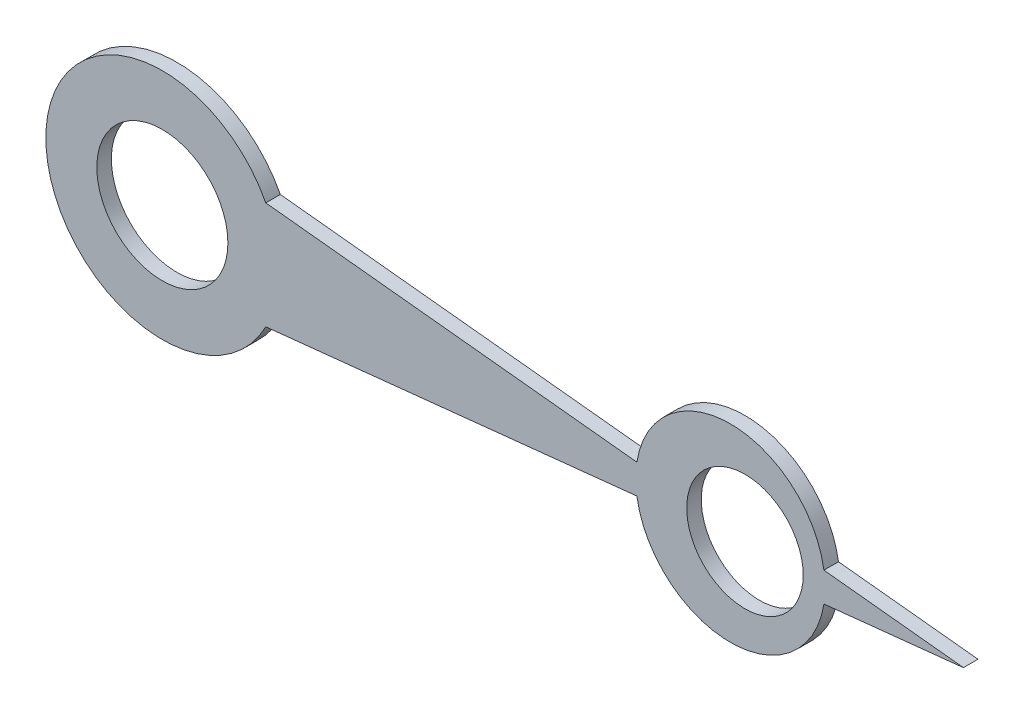
ISO-10303-21;
HEADER;
FILE_DESCRIPTION(('STEP AP214'),'2;1');
FILE_NAME('part.step','',(''),(''),'','','');
FILE_SCHEMA(('AUTOMOTIVE_DESIGN { 1 0 10303 214 1 1 1 1 }'));
ENDSEC;
DATA;
#1=APPLICATION_CONTEXT('core data for automotive mechanical design processes');
#2=APPLICATION_PROTOCOL_DEFINITION('international standard','automotive_design',2000,#1);
#3=PRODUCT_CONTEXT('',#1,'mechanical');
#4=PRODUCT('Part','Part','',(#3));
#5=PRODUCT_RELATED_PRODUCT_CATEGORY('part','',(#4));
#6=PRODUCT_DEFINITION_FORMATION('','',#4);
#7=PRODUCT_DEFINITION_CONTEXT('part definition',#1,'design');
#8=PRODUCT_DEFINITION('design','',#6,#7);
#9=PRODUCT_DEFINITION_SHAPE('','',#8);
#10=(LENGTH_UNIT() NAMED_UNIT(*) SI_UNIT(.MILLI.,.METRE.));
#11=(NAMED_UNIT(*) PLANE_ANGLE_UNIT() SI_UNIT($,.RADIAN.));
#12=(NAMED_UNIT(*) SI_UNIT($,.STERADIAN.) SOLID_ANGLE_UNIT());
#13=UNCERTAINTY_MEASURE_WITH_UNIT(LENGTH_MEASURE(1.E-05),#10,'distance_accuracy_value','');
#14=(GEOMETRIC_REPRESENTATION_CONTEXT(3) GLOBAL_UNCERTAINTY_ASSIGNED_CONTEXT((#13)) GLOBAL_UNIT_ASSIGNED_CONTEXT((#10,
#11,#12)) REPRESENTATION_CONTEXT('',''));
#15=CARTESIAN_POINT('',(0.,0.,0.));
#16=DIRECTION('',(0.,0.,1.));
#17=DIRECTION('',(1.,0.,0.));
#18=AXIS2_PLACEMENT_3D('',#15,#16,#17);
#19=CARTESIAN_POINT('',(39.,0.,20.));
#20=DIRECTION('',(0.,0.,1.));
#21=DIRECTION('',(1.,0.,0.));
#22=AXIS2_PLACEMENT_3D('',#19,#20,#21);
#23=PLANE('',#22);
#24=CARTESIAN_POINT('',(0.,0.,20.));
#25=DIRECTION('',(0.,0.,1.));
#26=DIRECTION('',(1.,0.,0.));
#27=AXIS2_PLACEMENT_3D('',#24,#25,#26);
#28=CIRCLE('',#27,4.5);
#29=CARTESIAN_POINT('',(4.5,0.,20.));
#30=VERTEX_POINT('',#29);
#31=EDGE_CURVE('E129',#30,#30,#28,.T.);
#32=ORIENTED_EDGE('',*,*,#31,.F.);
#33=EDGE_LOOP('',(#32));
#34=FACE_BOUND('',#33,.T.);
#35=DIRECTION('',(-0.994521895368274,0.104528463267647,0.));
#36=VECTOR('',#35,1.);
#37=CARTESIAN_POINT('',(55.,0.,20.));
#38=LINE('',#37,#36);
#39=CARTESIAN_POINT('',(55.,0.,20.));
#40=VERTEX_POINT('',#39);
#41=CARTESIAN_POINT('',(45.4215641633167,1.00673417365588,20.));
#42=VERTEX_POINT('',#41);
#43=EDGE_CURVE('E138',#40,#42,#38,.T.);
#44=ORIENTED_EDGE('',*,*,#43,.T.);
#45=CARTESIAN_POINT('',(39.,0.,20.));
#46=DIRECTION('',(0.,0.,1.));
#47=DIRECTION('',(1.,0.,0.));
#48=AXIS2_PLACEMENT_3D('',#45,#46,#47);
#49=CIRCLE('',#48,6.5);
#50=CARTESIAN_POINT('',(32.5784358366833,1.00673417365588,20.));
#51=VERTEX_POINT('',#50);
#52=EDGE_CURVE('E91',#42,#51,#49,.T.);
#53=ORIENTED_EDGE('',*,*,#52,.T.);
#54=DIRECTION('',(-0.994521895368273,0.104528463267654,0.));
#55=VECTOR('',#54,1.);
#56=CARTESIAN_POINT('',(7.10100797375704,3.6845197457252,20.));
#57=LINE('',#56,#55);
#58=CARTESIAN_POINT('',(7.10100797375704,3.6845197457252,20.));
#59=VERTEX_POINT('',#58);
#60=EDGE_CURVE('E150',#51,#59,#57,.T.);
#61=ORIENTED_EDGE('',*,*,#60,.T.);
#62=CARTESIAN_POINT('',(0.,0.,20.));
#63=DIRECTION('',(0.,0.,1.));
#64=DIRECTION('',(1.,0.,0.));
#65=AXIS2_PLACEMENT_3D('',#62,#63,#64);
#66=CIRCLE('',#65,8.);
#67=CARTESIAN_POINT('',(7.10100797375704,-3.6845197457252,20.));
#68=VERTEX_POINT('',#67);
#69=EDGE_CURVE('E107',#59,#68,#66,.T.);
#70=ORIENTED_EDGE('',*,*,#69,.T.);
#71=DIRECTION('',(0.994521895368273,0.104528463267654,0.));
#72=VECTOR('',#71,1.);
#73=CARTESIAN_POINT('',(7.10100797375704,-3.6845197457252,20.));
#74=LINE('',#73,#72);
#75=CARTESIAN_POINT('',(32.5784358366833,-1.00673417365587,20.));
#76=VERTEX_POINT('',#75);
#77=EDGE_CURVE('E101',#68,#76,#74,.T.);
#78=ORIENTED_EDGE('',*,*,#77,.T.);
#79=CARTESIAN_POINT('',(39.,0.,20.));
#80=DIRECTION('',(0.,0.,1.));
#81=DIRECTION('',(1.,0.,0.));
#82=AXIS2_PLACEMENT_3D('',#79,#80,#81);
#83=CIRCLE('',#82,6.5);
#84=CARTESIAN_POINT('',(45.4215641633167,-1.00673417365587,20.));
#85=VERTEX_POINT('',#84);
#86=EDGE_CURVE('E105',#76,#85,#83,.T.);
#87=ORIENTED_EDGE('',*,*,#86,.T.);
#88=DIRECTION('',(0.994521895368274,0.104528463267646,0.));
#89=VECTOR('',#88,1.);
#90=CARTESIAN_POINT('',(55.,0.,20.));
#91=LINE('',#90,#89);
#92=EDGE_CURVE('E51',#85,#40,#91,.T.);
#93=ORIENTED_EDGE('',*,*,#92,.T.);
#94=EDGE_LOOP('',(#44,#53,#61,#70,#78,#87,#93));
#95=FACE_BOUND('',#94,.T.);
#96=CARTESIAN_POINT('',(40.,0.,20.));
#97=DIRECTION('',(0.,0.,1.));
#98=DIRECTION('',(1.,0.,0.));
#99=AXIS2_PLACEMENT_3D('',#96,#97,#98);
#100=CIRCLE('',#99,4.00000000000001);
#101=CARTESIAN_POINT('',(44.,0.,20.));
#102=VERTEX_POINT('',#101);
#103=EDGE_CURVE('E165',#102,#102,#100,.T.);
#104=ORIENTED_EDGE('',*,*,#103,.F.);
#105=EDGE_LOOP('',(#104));
#106=FACE_BOUND('',#105,.T.);
#107=ADVANCED_FACE('F34',(#34,#95,#106),#23,.T.);
#108=CARTESIAN_POINT('',(39.,0.,19.));
#109=DIRECTION('',(0.,0.,1.));
#110=DIRECTION('',(1.,0.,0.));
#111=AXIS2_PLACEMENT_3D('',#108,#109,#110);
#112=PLANE('',#111);
#113=DIRECTION('',(-0.994521895368274,0.104528463267647,0.));
#114=VECTOR('',#113,1.);
#115=CARTESIAN_POINT('',(55.,0.,19.));
#116=LINE('',#115,#114);
#117=CARTESIAN_POINT('',(55.,0.,19.));
#118=VERTEX_POINT('',#117);
#119=CARTESIAN_POINT('',(45.4215641633167,1.00673417365588,19.));
#120=VERTEX_POINT('',#119);
#121=EDGE_CURVE('E125',#118,#120,#116,.T.);
#122=ORIENTED_EDGE('',*,*,#121,.F.);
#123=DIRECTION('',(0.994521895368274,0.104528463267646,0.));
#124=VECTOR('',#123,1.);
#125=CARTESIAN_POINT('',(55.,0.,19.));
#126=LINE('',#125,#124);
#127=CARTESIAN_POINT('',(45.4215641633167,-1.00673417365587,19.));
#128=VERTEX_POINT('',#127);
#129=EDGE_CURVE('E83',#128,#118,#126,.T.);
#130=ORIENTED_EDGE('',*,*,#129,.F.);
#131=CARTESIAN_POINT('',(39.,0.,19.));
#132=DIRECTION('',(0.,0.,1.));
#133=DIRECTION('',(1.,0.,0.));
#134=AXIS2_PLACEMENT_3D('',#131,#132,#133);
#135=CIRCLE('',#134,6.5);
#136=CARTESIAN_POINT('',(32.5784358366833,-1.00673417365587,19.));
#137=VERTEX_POINT('',#136);
#138=EDGE_CURVE('E77',#137,#128,#135,.T.);
#139=ORIENTED_EDGE('',*,*,#138,.F.);
#140=DIRECTION('',(0.994521895368273,0.104528463267654,0.));
#141=VECTOR('',#140,1.);
#142=CARTESIAN_POINT('',(7.10100797375704,-3.6845197457252,19.));
#143=LINE('',#142,#141);
#144=CARTESIAN_POINT('',(7.10100797375704,-3.6845197457252,19.));
#145=VERTEX_POINT('',#144);
#146=EDGE_CURVE('E115',#145,#137,#143,.T.);
#147=ORIENTED_EDGE('',*,*,#146,.F.);
#148=CARTESIAN_POINT('',(0.,0.,19.));
#149=DIRECTION('',(0.,0.,1.));
#150=DIRECTION('',(1.,0.,0.));
#151=AXIS2_PLACEMENT_3D('',#148,#149,#150);
#152=CIRCLE('',#151,8.);
#153=CARTESIAN_POINT('',(7.10100797375704,3.6845197457252,19.));
#154=VERTEX_POINT('',#153);
#155=EDGE_CURVE('E133',#154,#145,#152,.T.);
#156=ORIENTED_EDGE('',*,*,#155,.F.);
#157=DIRECTION('',(-0.994521895368273,0.104528463267654,0.));
#158=VECTOR('',#157,1.);
#159=CARTESIAN_POINT('',(7.10100797375704,3.6845197457252,19.));
#160=LINE('',#159,#158);
#161=CARTESIAN_POINT('',(32.5784358366833,1.00673417365588,19.));
#162=VERTEX_POINT('',#161);
#163=EDGE_CURVE('E131',#162,#154,#160,.T.);
#164=ORIENTED_EDGE('',*,*,#163,.F.);
#165=CARTESIAN_POINT('',(39.,0.,19.));
#166=DIRECTION('',(0.,0.,1.));
#167=DIRECTION('',(1.,0.,0.));
#168=AXIS2_PLACEMENT_3D('',#165,#166,#167);
#169=CIRCLE('',#168,6.5);
#170=EDGE_CURVE('E128',#120,#162,#169,.T.);
#171=ORIENTED_EDGE('',*,*,#170,.F.);
#172=EDGE_LOOP('',(#122,#130,#139,#147,#156,#164,#171));
#173=FACE_BOUND('',#172,.T.);
#174=CARTESIAN_POINT('',(0.,0.,19.));
#175=DIRECTION('',(0.,0.,1.));
#176=DIRECTION('',(1.,0.,0.));
#177=AXIS2_PLACEMENT_3D('',#174,#175,#176);
#178=CIRCLE('',#177,4.5);
#179=CARTESIAN_POINT('',(4.5,0.,19.));
#180=VERTEX_POINT('',#179);
#181=EDGE_CURVE('E162',#180,#180,#178,.T.);
#182=ORIENTED_EDGE('',*,*,#181,.T.);
#183=EDGE_LOOP('',(#182));
#184=FACE_BOUND('',#183,.T.);
#185=CARTESIAN_POINT('',(40.,0.,19.));
#186=DIRECTION('',(0.,0.,1.));
#187=DIRECTION('',(1.,0.,0.));
#188=AXIS2_PLACEMENT_3D('',#185,#186,#187);
#189=CIRCLE('',#188,4.00000000000001);
#190=CARTESIAN_POINT('',(44.,0.,19.));
#191=VERTEX_POINT('',#190);
#192=EDGE_CURVE('E168',#191,#191,#189,.T.);
#193=ORIENTED_EDGE('',*,*,#192,.T.);
#194=EDGE_LOOP('',(#193));
#195=FACE_BOUND('',#194,.T.);
#196=ADVANCED_FACE('F154',(#173,#184,#195),#112,.F.);
#197=CARTESIAN_POINT('',(55.,0.,20.));
#198=DIRECTION('',(-0.104528463267647,-0.994521895368274,0.));
#199=DIRECTION('',(0.994521895368274,-0.104528463267647,0.));
#200=AXIS2_PLACEMENT_3D('',#197,#198,#199);
#201=PLANE('',#200);
#202=ORIENTED_EDGE('',*,*,#121,.T.);
#203=DIRECTION('',(0.,0.,-1.));
#204=VECTOR('',#203,1.);
#205=CARTESIAN_POINT('',(45.4215641633167,1.00673417365588,20.));
#206=LINE('',#205,#204);
#207=EDGE_CURVE('E11',#42,#120,#206,.T.);
#208=ORIENTED_EDGE('',*,*,#207,.F.);
#209=ORIENTED_EDGE('',*,*,#43,.F.);
#210=DIRECTION('',(0.,0.,-1.));
#211=VECTOR('',#210,1.);
#212=CARTESIAN_POINT('',(55.,0.,20.));
#213=LINE('',#212,#211);
#214=EDGE_CURVE('E121',#40,#118,#213,.T.);
#215=ORIENTED_EDGE('',*,*,#214,.T.);
#216=EDGE_LOOP('',(#202,#208,#209,#215));
#217=FACE_BOUND('',#216,.T.);
#218=ADVANCED_FACE('F36',(#217),#201,.F.);
#219=CARTESIAN_POINT('',(39.,0.,20.));
#220=DIRECTION('',(0.,0.,-1.));
#221=DIRECTION('',(-1.,0.,0.));
#222=AXIS2_PLACEMENT_3D('',#219,#220,#221);
#223=CYLINDRICAL_SURFACE('',#222,6.5);
#224=ORIENTED_EDGE('',*,*,#170,.T.);
#225=DIRECTION('',(0.,0.,-1.));
#226=VECTOR('',#225,1.);
#227=CARTESIAN_POINT('',(32.5784358366833,1.00673417365588,20.));
#228=LINE('',#227,#226);
#229=EDGE_CURVE('E43',#51,#162,#228,.T.);
#230=ORIENTED_EDGE('',*,*,#229,.F.);
#231=ORIENTED_EDGE('',*,*,#52,.F.);
#232=ORIENTED_EDGE('',*,*,#207,.T.);
#233=EDGE_LOOP('',(#224,#230,#231,#232));
#234=FACE_BOUND('',#233,.T.);
#235=ADVANCED_FACE('F198',(#234),#223,.T.);
#236=CARTESIAN_POINT('',(7.10100797375704,3.6845197457252,20.));
#237=DIRECTION('',(-0.104528463267654,-0.994521895368273,0.));
#238=DIRECTION('',(0.994521895368273,-0.104528463267654,0.));
#239=AXIS2_PLACEMENT_3D('',#236,#237,#238);
#240=PLANE('',#239);
#241=ORIENTED_EDGE('',*,*,#163,.T.);
#242=DIRECTION('',(0.,0.,-1.));
#243=VECTOR('',#242,1.);
#244=CARTESIAN_POINT('',(7.10100797375704,3.6845197457252,20.));
#245=LINE('',#244,#243);
#246=EDGE_CURVE('E142',#59,#154,#245,.T.);
#247=ORIENTED_EDGE('',*,*,#246,.F.);
#248=ORIENTED_EDGE('',*,*,#60,.F.);
#249=ORIENTED_EDGE('',*,*,#229,.T.);
#250=EDGE_LOOP('',(#241,#247,#248,#249));
#251=FACE_BOUND('',#250,.T.);
#252=ADVANCED_FACE('F148',(#251),#240,.F.);
#253=CARTESIAN_POINT('',(0.,0.,20.));
#254=DIRECTION('',(0.,0.,-1.));
#255=DIRECTION('',(-1.,0.,0.));
#256=AXIS2_PLACEMENT_3D('',#253,#254,#255);
#257=CYLINDRICAL_SURFACE('',#256,8.);
#258=ORIENTED_EDGE('',*,*,#155,.T.);
#259=DIRECTION('',(0.,0.,-1.));
#260=VECTOR('',#259,1.);
#261=CARTESIAN_POINT('',(7.10100797375704,-3.6845197457252,20.));
#262=LINE('',#261,#260);
#263=EDGE_CURVE('E116',#68,#145,#262,.T.);
#264=ORIENTED_EDGE('',*,*,#263,.F.);
#265=ORIENTED_EDGE('',*,*,#69,.F.);
#266=ORIENTED_EDGE('',*,*,#246,.T.);
#267=EDGE_LOOP('',(#258,#264,#265,#266));
#268=FACE_BOUND('',#267,.T.);
#269=ADVANCED_FACE('F157',(#268),#257,.T.);
#270=CARTESIAN_POINT('',(7.10100797375704,-3.6845197457252,20.));
#271=DIRECTION('',(-0.104528463267654,0.994521895368273,0.));
#272=DIRECTION('',(-0.994521895368273,-0.104528463267654,0.));
#273=AXIS2_PLACEMENT_3D('',#270,#271,#272);
#274=PLANE('',#273);
#275=ORIENTED_EDGE('',*,*,#146,.T.);
#276=DIRECTION('',(0.,0.,-1.));
#277=VECTOR('',#276,1.);
#278=CARTESIAN_POINT('',(32.5784358366833,-1.00673417365587,20.));
#279=LINE('',#278,#277);
#280=EDGE_CURVE('E112',#76,#137,#279,.T.);
#281=ORIENTED_EDGE('',*,*,#280,.F.);
#282=ORIENTED_EDGE('',*,*,#77,.F.);
#283=ORIENTED_EDGE('',*,*,#263,.T.);
#284=EDGE_LOOP('',(#275,#281,#282,#283));
#285=FACE_BOUND('',#284,.T.);
#286=ADVANCED_FACE('F113',(#285),#274,.F.);
#287=CARTESIAN_POINT('',(39.,0.,20.));
#288=DIRECTION('',(0.,0.,-1.));
#289=DIRECTION('',(-1.,0.,0.));
#290=AXIS2_PLACEMENT_3D('',#287,#288,#289);
#291=CYLINDRICAL_SURFACE('',#290,6.5);
#292=ORIENTED_EDGE('',*,*,#138,.T.);
#293=DIRECTION('',(0.,0.,-1.));
#294=VECTOR('',#293,1.);
#295=CARTESIAN_POINT('',(45.4215641633167,-1.00673417365587,20.));
#296=LINE('',#295,#294);
#297=EDGE_CURVE('E117',#85,#128,#296,.T.);
#298=ORIENTED_EDGE('',*,*,#297,.F.);
#299=ORIENTED_EDGE('',*,*,#86,.F.);
#300=ORIENTED_EDGE('',*,*,#280,.T.);
#301=EDGE_LOOP('',(#292,#298,#299,#300));
#302=FACE_BOUND('',#301,.T.);
#303=ADVANCED_FACE('F119',(#302),#291,.T.);
#304=CARTESIAN_POINT('',(55.,0.,20.));
#305=DIRECTION('',(-0.104528463267646,0.994521895368274,0.));
#306=DIRECTION('',(-0.994521895368274,-0.104528463267646,0.));
#307=AXIS2_PLACEMENT_3D('',#304,#305,#306);
#308=PLANE('',#307);
#309=ORIENTED_EDGE('',*,*,#129,.T.);
#310=ORIENTED_EDGE('',*,*,#214,.F.);
#311=ORIENTED_EDGE('',*,*,#92,.F.);
#312=ORIENTED_EDGE('',*,*,#297,.T.);
#313=EDGE_LOOP('',(#309,#310,#311,#312));
#314=FACE_BOUND('',#313,.T.);
#315=ADVANCED_FACE('F188',(#314),#308,.F.);
#316=CARTESIAN_POINT('',(0.,0.,20.));
#317=DIRECTION('',(0.,0.,-1.));
#318=DIRECTION('',(-1.,0.,0.));
#319=AXIS2_PLACEMENT_3D('',#316,#317,#318);
#320=CYLINDRICAL_SURFACE('',#319,4.5);
#321=ORIENTED_EDGE('',*,*,#31,.T.);
#322=EDGE_LOOP('',(#321));
#323=FACE_BOUND('',#322,.T.);
#324=ORIENTED_EDGE('',*,*,#181,.F.);
#325=EDGE_LOOP('',(#324));
#326=FACE_BOUND('',#325,.T.);
#327=ADVANCED_FACE('F185',(#323,#326),#320,.F.);
#328=CARTESIAN_POINT('',(40.,0.,20.));
#329=DIRECTION('',(0.,0.,-1.));
#330=DIRECTION('',(-1.,0.,0.));
#331=AXIS2_PLACEMENT_3D('',#328,#329,#330);
#332=CYLINDRICAL_SURFACE('',#331,4.00000000000001);
#333=ORIENTED_EDGE('',*,*,#103,.T.);
#334=EDGE_LOOP('',(#333));
#335=FACE_BOUND('',#334,.T.);
#336=ORIENTED_EDGE('',*,*,#192,.F.);
#337=EDGE_LOOP('',(#336));
#338=FACE_BOUND('',#337,.T.);
#339=ADVANCED_FACE('F174',(#335,#338),#332,.F.);
#340=CLOSED_SHELL('',(#107,#196,#218,#235,#252,#269,#286,#303,#315,#327,#339));
#341=MANIFOLD_SOLID_BREP('B2',#340);
#342=ADVANCED_BREP_SHAPE_REPRESENTATION('',(#18,#341),#14);
#343=SHAPE_DEFINITION_REPRESENTATION(#9,#342);
ENDSEC;
END-ISO-10303-21;
